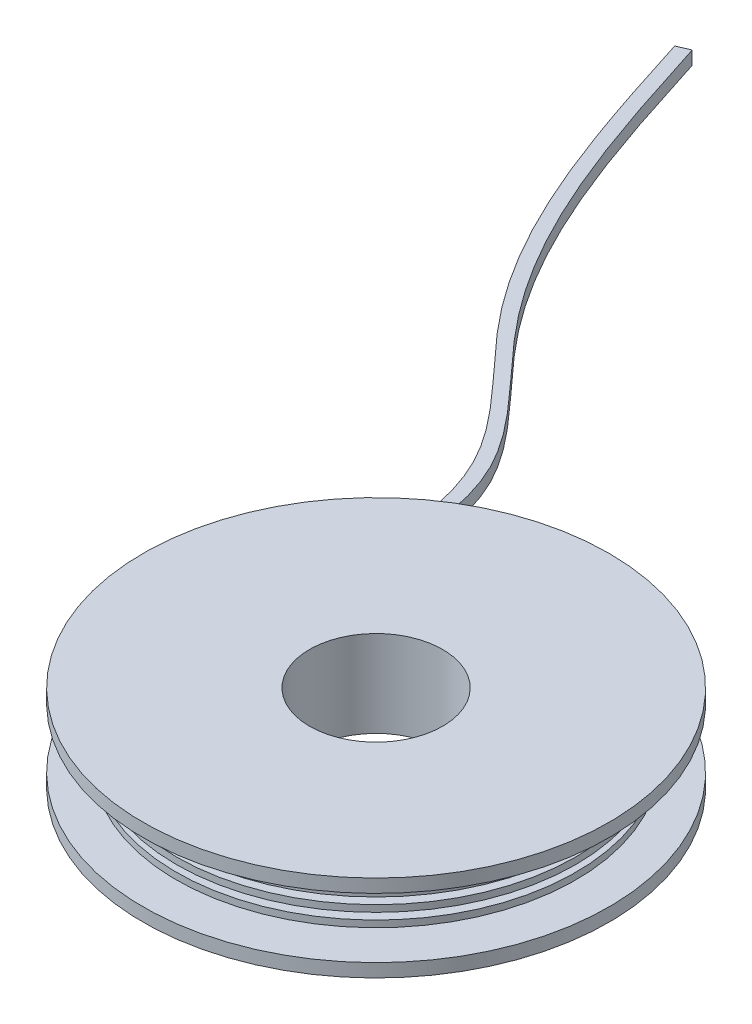
ISO-10303-21;
HEADER;
FILE_DESCRIPTION(('STEP AP214'),'2;1');
FILE_NAME('part.step','',(''),(''),'','','');
FILE_SCHEMA(('AUTOMOTIVE_DESIGN { 1 0 10303 214 1 1 1 1 }'));
ENDSEC;
DATA;
#1=APPLICATION_CONTEXT('core data for automotive mechanical design processes');
#2=APPLICATION_PROTOCOL_DEFINITION('international standard','automotive_design',2000,#1);
#3=PRODUCT_CONTEXT('',#1,'mechanical');
#4=PRODUCT('Part','Part','',(#3));
#5=PRODUCT_RELATED_PRODUCT_CATEGORY('part','',(#4));
#6=PRODUCT_DEFINITION_FORMATION('','',#4);
#7=PRODUCT_DEFINITION_CONTEXT('part definition',#1,'design');
#8=PRODUCT_DEFINITION('design','',#6,#7);
#9=PRODUCT_DEFINITION_SHAPE('','',#8);
#10=(LENGTH_UNIT() NAMED_UNIT(*) SI_UNIT(.MILLI.,.METRE.));
#11=(NAMED_UNIT(*) PLANE_ANGLE_UNIT() SI_UNIT($,.RADIAN.));
#12=(NAMED_UNIT(*) SI_UNIT($,.STERADIAN.) SOLID_ANGLE_UNIT());
#13=UNCERTAINTY_MEASURE_WITH_UNIT(LENGTH_MEASURE(1.E-05),#10,'distance_accuracy_value','');
#14=(GEOMETRIC_REPRESENTATION_CONTEXT(3) GLOBAL_UNCERTAINTY_ASSIGNED_CONTEXT((#13)) GLOBAL_UNIT_ASSIGNED_CONTEXT((#10,
#11,#12)) REPRESENTATION_CONTEXT('',''));
#15=CARTESIAN_POINT('',(0.,0.,0.));
#16=DIRECTION('',(0.,0.,1.));
#17=DIRECTION('',(1.,0.,0.));
#18=AXIS2_PLACEMENT_3D('',#15,#16,#17);
#19=CARTESIAN_POINT('',(0.,13.,0.));
#20=DIRECTION('',(0.,1.,0.));
#21=DIRECTION('',(0.,0.,1.));
#22=AXIS2_PLACEMENT_3D('',#19,#20,#21);
#23=PLANE('',#22);
#24=CARTESIAN_POINT('',(0.,13.,0.));
#25=DIRECTION('',(0.,1.,0.));
#26=DIRECTION('',(0.,0.,1.));
#27=AXIS2_PLACEMENT_3D('',#24,#25,#26);
#28=CIRCLE('',#27,10.);
#29=CARTESIAN_POINT('',(0.,13.,10.));
#30=VERTEX_POINT('',#29);
#31=EDGE_CURVE('E114',#30,#30,#28,.T.);
#32=ORIENTED_EDGE('',*,*,#31,.F.);
#33=EDGE_LOOP('',(#32));
#34=FACE_BOUND('',#33,.T.);
#35=CARTESIAN_POINT('',(0.,13.,0.));
#36=DIRECTION('',(0.,-1.,0.));
#37=DIRECTION('',(0.,0.,-1.));
#38=AXIS2_PLACEMENT_3D('',#35,#36,#37);
#39=CIRCLE('',#38,35.);
#40=CARTESIAN_POINT('',(0.,13.,-35.));
#41=VERTEX_POINT('',#40);
#42=EDGE_CURVE('E11',#41,#41,#39,.T.);
#43=ORIENTED_EDGE('',*,*,#42,.F.);
#44=EDGE_LOOP('',(#43));
#45=FACE_BOUND('',#44,.T.);
#46=ADVANCED_FACE('F31',(#34,#45),#23,.T.);
#47=CARTESIAN_POINT('',(0.,0.,0.));
#48=DIRECTION('',(0.,-1.,0.));
#49=DIRECTION('',(0.,0.,-1.));
#50=AXIS2_PLACEMENT_3D('',#47,#48,#49);
#51=CYLINDRICAL_SURFACE('',#50,35.);
#52=ORIENTED_EDGE('',*,*,#42,.T.);
#53=EDGE_LOOP('',(#52));
#54=FACE_BOUND('',#53,.T.);
#55=CARTESIAN_POINT('',(0.,11.,0.));
#56=DIRECTION('',(0.,-1.,0.));
#57=DIRECTION('',(0.,0.,-1.));
#58=AXIS2_PLACEMENT_3D('',#55,#56,#57);
#59=CIRCLE('',#58,35.);
#60=CARTESIAN_POINT('',(0.,11.,-35.));
#61=VERTEX_POINT('',#60);
#62=EDGE_CURVE('E38',#61,#61,#59,.T.);
#63=ORIENTED_EDGE('',*,*,#62,.F.);
#64=EDGE_LOOP('',(#63));
#65=FACE_BOUND('',#64,.T.);
#66=ADVANCED_FACE('F231',(#54,#65),#51,.T.);
#67=CARTESIAN_POINT('',(35.,11.,0.));
#68=DIRECTION('',(0.,-1.,0.));
#69=DIRECTION('',(0.,0.,-1.));
#70=AXIS2_PLACEMENT_3D('',#67,#68,#69);
#71=PLANE('',#70);
#72=ORIENTED_EDGE('',*,*,#62,.T.);
#73=EDGE_LOOP('',(#72));
#74=FACE_BOUND('',#73,.T.);
#75=CARTESIAN_POINT('',(0.,11.,0.));
#76=DIRECTION('',(0.,-1.,0.));
#77=DIRECTION('',(0.,0.,-1.));
#78=AXIS2_PLACEMENT_3D('',#75,#76,#77);
#79=CIRCLE('',#78,25.);
#80=CARTESIAN_POINT('',(0.,11.,-25.));
#81=VERTEX_POINT('',#80);
#82=EDGE_CURVE('E243',#81,#81,#79,.T.);
#83=ORIENTED_EDGE('',*,*,#82,.F.);
#84=EDGE_LOOP('',(#83));
#85=FACE_BOUND('',#84,.T.);
#86=ADVANCED_FACE('F228',(#74,#85),#71,.T.);
#87=CARTESIAN_POINT('',(0.,0.,0.));
#88=DIRECTION('',(0.,-1.,0.));
#89=DIRECTION('',(0.,0.,-1.));
#90=AXIS2_PLACEMENT_3D('',#87,#88,#89);
#91=CYLINDRICAL_SURFACE('',#90,25.);
#92=ORIENTED_EDGE('',*,*,#82,.T.);
#93=EDGE_LOOP('',(#92));
#94=FACE_BOUND('',#93,.T.);
#95=CARTESIAN_POINT('',(0.,9.99999999999999,0.));
#96=DIRECTION('',(0.,-1.,0.));
#97=DIRECTION('',(0.,0.,-1.));
#98=AXIS2_PLACEMENT_3D('',#95,#96,#97);
#99=CIRCLE('',#98,25.);
#100=CARTESIAN_POINT('',(0.,9.99999999999999,-25.));
#101=VERTEX_POINT('',#100);
#102=EDGE_CURVE('E245',#101,#101,#99,.T.);
#103=ORIENTED_EDGE('',*,*,#102,.F.);
#104=EDGE_LOOP('',(#103));
#105=FACE_BOUND('',#104,.T.);
#106=ADVANCED_FACE('F224',(#94,#105),#91,.T.);
#107=CARTESIAN_POINT('',(25.,9.99999999999999,0.));
#108=DIRECTION('',(0.,1.,0.));
#109=DIRECTION('',(0.,0.,1.));
#110=AXIS2_PLACEMENT_3D('',#107,#108,#109);
#111=PLANE('',#110);
#112=ORIENTED_EDGE('',*,*,#102,.T.);
#113=EDGE_LOOP('',(#112));
#114=FACE_BOUND('',#113,.T.);
#115=CARTESIAN_POINT('',(0.,9.99999999999999,0.));
#116=DIRECTION('',(0.,-1.,0.));
#117=DIRECTION('',(0.,0.,-1.));
#118=AXIS2_PLACEMENT_3D('',#115,#116,#117);
#119=CIRCLE('',#118,30.);
#120=CARTESIAN_POINT('',(0.,9.99999999999999,-30.));
#121=VERTEX_POINT('',#120);
#122=EDGE_CURVE('E250',#121,#121,#119,.T.);
#123=ORIENTED_EDGE('',*,*,#122,.F.);
#124=EDGE_LOOP('',(#123));
#125=FACE_BOUND('',#124,.T.);
#126=ADVANCED_FACE('F220',(#114,#125),#111,.T.);
#127=CARTESIAN_POINT('',(0.,0.,0.));
#128=DIRECTION('',(0.,-1.,0.));
#129=DIRECTION('',(0.,0.,-1.));
#130=AXIS2_PLACEMENT_3D('',#127,#128,#129);
#131=CYLINDRICAL_SURFACE('',#130,30.);
#132=ORIENTED_EDGE('',*,*,#122,.T.);
#133=EDGE_LOOP('',(#132));
#134=FACE_BOUND('',#133,.T.);
#135=CARTESIAN_POINT('',(0.,8.99999999999999,0.));
#136=DIRECTION('',(0.,-1.,0.));
#137=DIRECTION('',(0.,0.,-1.));
#138=AXIS2_PLACEMENT_3D('',#135,#136,#137);
#139=CIRCLE('',#138,30.);
#140=CARTESIAN_POINT('',(0.,8.99999999999999,-30.));
#141=VERTEX_POINT('',#140);
#142=EDGE_CURVE('E253',#141,#141,#139,.T.);
#143=ORIENTED_EDGE('',*,*,#142,.F.);
#144=EDGE_LOOP('',(#143));
#145=FACE_BOUND('',#144,.T.);
#146=ADVANCED_FACE('F216',(#134,#145),#131,.T.);
#147=CARTESIAN_POINT('',(30.,8.99999999999999,0.));
#148=DIRECTION('',(0.,-1.,0.));
#149=DIRECTION('',(0.,0.,-1.));
#150=AXIS2_PLACEMENT_3D('',#147,#148,#149);
#151=PLANE('',#150);
#152=ORIENTED_EDGE('',*,*,#142,.T.);
#153=EDGE_LOOP('',(#152));
#154=FACE_BOUND('',#153,.T.);
#155=CARTESIAN_POINT('',(0.,8.99999999999999,0.));
#156=DIRECTION('',(0.,-1.,0.));
#157=DIRECTION('',(0.,0.,-1.));
#158=AXIS2_PLACEMENT_3D('',#155,#156,#157);
#159=CIRCLE('',#158,25.);
#160=CARTESIAN_POINT('',(0.,8.99999999999999,-25.));
#161=VERTEX_POINT('',#160);
#162=EDGE_CURVE('E256',#161,#161,#159,.T.);
#163=ORIENTED_EDGE('',*,*,#162,.F.);
#164=EDGE_LOOP('',(#163));
#165=FACE_BOUND('',#164,.T.);
#166=ADVANCED_FACE('F212',(#154,#165),#151,.T.);
#167=CARTESIAN_POINT('',(0.,0.,0.));
#168=DIRECTION('',(0.,-1.,0.));
#169=DIRECTION('',(0.,0.,-1.));
#170=AXIS2_PLACEMENT_3D('',#167,#168,#169);
#171=CYLINDRICAL_SURFACE('',#170,25.);
#172=ORIENTED_EDGE('',*,*,#162,.T.);
#173=EDGE_LOOP('',(#172));
#174=FACE_BOUND('',#173,.T.);
#175=CARTESIAN_POINT('',(0.,7.99999999999999,0.));
#176=DIRECTION('',(0.,-1.,0.));
#177=DIRECTION('',(0.,0.,-1.));
#178=AXIS2_PLACEMENT_3D('',#175,#176,#177);
#179=CIRCLE('',#178,25.);
#180=CARTESIAN_POINT('',(0.,7.99999999999999,-25.));
#181=VERTEX_POINT('',#180);
#182=EDGE_CURVE('E259',#181,#181,#179,.T.);
#183=ORIENTED_EDGE('',*,*,#182,.F.);
#184=EDGE_LOOP('',(#183));
#185=FACE_BOUND('',#184,.T.);
#186=ADVANCED_FACE('F208',(#174,#185),#171,.T.);
#187=CARTESIAN_POINT('',(25.,7.99999999999999,0.));
#188=DIRECTION('',(0.,1.,0.));
#189=DIRECTION('',(0.,0.,1.));
#190=AXIS2_PLACEMENT_3D('',#187,#188,#189);
#191=PLANE('',#190);
#192=ORIENTED_EDGE('',*,*,#182,.T.);
#193=EDGE_LOOP('',(#192));
#194=FACE_BOUND('',#193,.T.);
#195=CARTESIAN_POINT('',(0.,8.,0.));
#196=DIRECTION('',(0.,-1.,0.));
#197=DIRECTION('',(0.,0.,-1.));
#198=AXIS2_PLACEMENT_3D('',#195,#196,#197);
#199=CIRCLE('',#198,30.);
#200=CARTESIAN_POINT('',(0.,8.,-30.));
#201=VERTEX_POINT('',#200);
#202=EDGE_CURVE('E262',#201,#201,#199,.T.);
#203=ORIENTED_EDGE('',*,*,#202,.F.);
#204=EDGE_LOOP('',(#203));
#205=FACE_BOUND('',#204,.T.);
#206=ADVANCED_FACE('F204',(#194,#205),#191,.T.);
#207=CARTESIAN_POINT('',(0.,0.,0.));
#208=DIRECTION('',(0.,-1.,0.));
#209=DIRECTION('',(0.,0.,-1.));
#210=AXIS2_PLACEMENT_3D('',#207,#208,#209);
#211=CYLINDRICAL_SURFACE('',#210,30.);
#212=ORIENTED_EDGE('',*,*,#202,.T.);
#213=EDGE_LOOP('',(#212));
#214=FACE_BOUND('',#213,.T.);
#215=CARTESIAN_POINT('',(0.,7.,0.));
#216=DIRECTION('',(0.,-1.,0.));
#217=DIRECTION('',(0.,0.,-1.));
#218=AXIS2_PLACEMENT_3D('',#215,#216,#217);
#219=CIRCLE('',#218,30.);
#220=CARTESIAN_POINT('',(0.,7.,-30.));
#221=VERTEX_POINT('',#220);
#222=EDGE_CURVE('E265',#221,#221,#219,.T.);
#223=ORIENTED_EDGE('',*,*,#222,.F.);
#224=EDGE_LOOP('',(#223));
#225=FACE_BOUND('',#224,.T.);
#226=ADVANCED_FACE('F200',(#214,#225),#211,.T.);
#227=CARTESIAN_POINT('',(30.,7.,0.));
#228=DIRECTION('',(0.,-1.,0.));
#229=DIRECTION('',(0.,0.,-1.));
#230=AXIS2_PLACEMENT_3D('',#227,#228,#229);
#231=PLANE('',#230);
#232=ORIENTED_EDGE('',*,*,#222,.T.);
#233=EDGE_LOOP('',(#232));
#234=FACE_BOUND('',#233,.T.);
#235=CARTESIAN_POINT('',(0.,7.,0.));
#236=DIRECTION('',(0.,-1.,0.));
#237=DIRECTION('',(0.,0.,-1.));
#238=AXIS2_PLACEMENT_3D('',#235,#236,#237);
#239=CIRCLE('',#238,25.);
#240=CARTESIAN_POINT('',(0.,7.,-25.));
#241=VERTEX_POINT('',#240);
#242=EDGE_CURVE('E268',#241,#241,#239,.T.);
#243=ORIENTED_EDGE('',*,*,#242,.F.);
#244=EDGE_LOOP('',(#243));
#245=FACE_BOUND('',#244,.T.);
#246=ADVANCED_FACE('F196',(#234,#245),#231,.T.);
#247=CARTESIAN_POINT('',(0.,0.,0.));
#248=DIRECTION('',(0.,-1.,0.));
#249=DIRECTION('',(0.,0.,-1.));
#250=AXIS2_PLACEMENT_3D('',#247,#248,#249);
#251=CYLINDRICAL_SURFACE('',#250,25.);
#252=ORIENTED_EDGE('',*,*,#242,.T.);
#253=EDGE_LOOP('',(#252));
#254=FACE_BOUND('',#253,.T.);
#255=CARTESIAN_POINT('',(0.,6.,0.));
#256=DIRECTION('',(0.,-1.,0.));
#257=DIRECTION('',(0.,0.,-1.));
#258=AXIS2_PLACEMENT_3D('',#255,#256,#257);
#259=CIRCLE('',#258,25.);
#260=CARTESIAN_POINT('',(0.,6.,-25.));
#261=VERTEX_POINT('',#260);
#262=EDGE_CURVE('E271',#261,#261,#259,.T.);
#263=ORIENTED_EDGE('',*,*,#262,.F.);
#264=EDGE_LOOP('',(#263));
#265=FACE_BOUND('',#264,.T.);
#266=ADVANCED_FACE('F192',(#254,#265),#251,.T.);
#267=CARTESIAN_POINT('',(30.,6.,0.));
#268=DIRECTION('',(0.,1.,0.));
#269=DIRECTION('',(0.,0.,1.));
#270=AXIS2_PLACEMENT_3D('',#267,#268,#269);
#271=PLANE('',#270);
#272=ORIENTED_EDGE('',*,*,#262,.T.);
#273=EDGE_LOOP('',(#272));
#274=FACE_BOUND('',#273,.T.);
#275=CARTESIAN_POINT('',(0.,6.,0.));
#276=DIRECTION('',(0.,-1.,0.));
#277=DIRECTION('',(0.,0.,-1.));
#278=AXIS2_PLACEMENT_3D('',#275,#276,#277);
#279=CIRCLE('',#278,30.);
#280=CARTESIAN_POINT('',(0.,6.,-30.));
#281=VERTEX_POINT('',#280);
#282=EDGE_CURVE('E274',#281,#281,#279,.T.);
#283=ORIENTED_EDGE('',*,*,#282,.F.);
#284=EDGE_LOOP('',(#283));
#285=FACE_BOUND('',#284,.T.);
#286=ADVANCED_FACE('F188',(#274,#285),#271,.T.);
#287=CARTESIAN_POINT('',(0.,0.,0.));
#288=DIRECTION('',(0.,-1.,0.));
#289=DIRECTION('',(0.,0.,-1.));
#290=AXIS2_PLACEMENT_3D('',#287,#288,#289);
#291=CYLINDRICAL_SURFACE('',#290,30.);
#292=ORIENTED_EDGE('',*,*,#282,.T.);
#293=EDGE_LOOP('',(#292));
#294=FACE_BOUND('',#293,.T.);
#295=CARTESIAN_POINT('',(0.,5.,0.));
#296=DIRECTION('',(0.,-1.,0.));
#297=DIRECTION('',(0.,0.,-1.));
#298=AXIS2_PLACEMENT_3D('',#295,#296,#297);
#299=CIRCLE('',#298,30.);
#300=CARTESIAN_POINT('',(0.,5.,-30.));
#301=VERTEX_POINT('',#300);
#302=EDGE_CURVE('E277',#301,#301,#299,.T.);
#303=ORIENTED_EDGE('',*,*,#302,.F.);
#304=EDGE_LOOP('',(#303));
#305=FACE_BOUND('',#304,.T.);
#306=ADVANCED_FACE('F184',(#294,#305),#291,.T.);
#307=CARTESIAN_POINT('',(25.,5.,0.));
#308=DIRECTION('',(0.,-1.,0.));
#309=DIRECTION('',(0.,0.,-1.));
#310=AXIS2_PLACEMENT_3D('',#307,#308,#309);
#311=PLANE('',#310);
#312=ORIENTED_EDGE('',*,*,#302,.T.);
#313=EDGE_LOOP('',(#312));
#314=FACE_BOUND('',#313,.T.);
#315=CARTESIAN_POINT('',(0.,5.,0.));
#316=DIRECTION('',(0.,-1.,0.));
#317=DIRECTION('',(0.,0.,-1.));
#318=AXIS2_PLACEMENT_3D('',#315,#316,#317);
#319=CIRCLE('',#318,25.);
#320=CARTESIAN_POINT('',(0.,5.,-25.));
#321=VERTEX_POINT('',#320);
#322=EDGE_CURVE('E280',#321,#321,#319,.T.);
#323=ORIENTED_EDGE('',*,*,#322,.F.);
#324=EDGE_LOOP('',(#323));
#325=FACE_BOUND('',#324,.T.);
#326=ADVANCED_FACE('F180',(#314,#325),#311,.T.);
#327=CARTESIAN_POINT('',(0.,0.,0.));
#328=DIRECTION('',(0.,-1.,0.));
#329=DIRECTION('',(0.,0.,-1.));
#330=AXIS2_PLACEMENT_3D('',#327,#328,#329);
#331=CYLINDRICAL_SURFACE('',#330,25.);
#332=ORIENTED_EDGE('',*,*,#322,.T.);
#333=EDGE_LOOP('',(#332));
#334=FACE_BOUND('',#333,.T.);
#335=CARTESIAN_POINT('',(0.,4.,0.));
#336=DIRECTION('',(0.,-1.,0.));
#337=DIRECTION('',(0.,0.,-1.));
#338=AXIS2_PLACEMENT_3D('',#335,#336,#337);
#339=CIRCLE('',#338,25.);
#340=CARTESIAN_POINT('',(0.,4.,-25.));
#341=VERTEX_POINT('',#340);
#342=EDGE_CURVE('E283',#341,#341,#339,.T.);
#343=ORIENTED_EDGE('',*,*,#342,.F.);
#344=EDGE_LOOP('',(#343));
#345=FACE_BOUND('',#344,.T.);
#346=ADVANCED_FACE('F176',(#334,#345),#331,.T.);
#347=CARTESIAN_POINT('',(30.,4.,0.));
#348=DIRECTION('',(0.,1.,0.));
#349=DIRECTION('',(0.,0.,1.));
#350=AXIS2_PLACEMENT_3D('',#347,#348,#349);
#351=PLANE('',#350);
#352=CARTESIAN_POINT('',(0.,4.,0.));
#353=DIRECTION('',(0.,-1.,0.));
#354=DIRECTION('',(0.,0.,-1.));
#355=AXIS2_PLACEMENT_3D('',#352,#353,#354);
#356=CIRCLE('',#355,30.);
#357=CARTESIAN_POINT('',(-27.3272002121338,4.,-12.3783734216557));
#358=VERTEX_POINT('',#357);
#359=CARTESIAN_POINT('',(-29.3272002121338,4.,-6.31785784245082));
#360=VERTEX_POINT('',#359);
#361=EDGE_CURVE('E49',#358,#360,#356,.T.);
#362=ORIENTED_EDGE('',*,*,#361,.F.);
#363=CARTESIAN_POINT('',(-68.2349270573465,4.,-115.720051734681));
#364=CARTESIAN_POINT('',(-62.6677313254013,4.,-98.1876957146622));
#365=CARTESIAN_POINT('',(-54.5190497611558,4.,-72.5256581005833));
#366=CARTESIAN_POINT('',(-23.311002372019,4.,-45.1883087801359));
#367=CARTESIAN_POINT('',(-25.5840102643851,4.,-25.0966753384625));
#368=CARTESIAN_POINT('',(-27.3272002121338,4.,-12.3783734216557));
#369=B_SPLINE_CURVE_WITH_KNOTS('',3,(#363,#364,#365,#366,#367,#368),.UNSPECIFIED.,.F.,.F.,(4,1,
1,4),(0.,0.472576041097984,0.691707613530188,1.),.UNSPECIFIED.);
#370=CARTESIAN_POINT('',(-68.2349270573465,4.,-115.720051734681));
#371=VERTEX_POINT('',#370);
#372=EDGE_CURVE('E133',#371,#358,#369,.T.);
#373=ORIENTED_EDGE('',*,*,#372,.F.);
#374=DIRECTION('',(0.9172292603573,0.,-0.398359741872094));
#375=VECTOR('',#374,1.);
#376=CARTESIAN_POINT('',(-70.0693855780611,4.,-114.923332250937));
#377=LINE('',#376,#375);
#378=CARTESIAN_POINT('',(-70.0693855780611,4.,-114.923332250937));
#379=VERTEX_POINT('',#378);
#380=EDGE_CURVE('E93',#379,#371,#377,.T.);
#381=ORIENTED_EDGE('',*,*,#380,.F.);
#382=CARTESIAN_POINT('',(-29.3272002121338,4.,-6.31785784245081));
#383=CARTESIAN_POINT('',(-27.376461724873,4.,-20.5051174359009));
#384=CARTESIAN_POINT('',(-24.1795196633313,4.,-43.755720850201));
#385=CARTESIAN_POINT('',(-56.295044404957,4.,-71.5733088298242));
#386=CARTESIAN_POINT('',(-64.4784596946282,4.,-97.3278069951977));
#387=CARTESIAN_POINT('',(-70.0693855780611,4.,-114.923332250937));
#388=B_SPLINE_CURVE_WITH_KNOTS('',3,(#382,#383,#384,#385,#386,#387),.UNSPECIFIED.,.F.,.F.,(4,1,
1,4),(0.,0.331505275215326,0.543283051459661,1.),.UNSPECIFIED.);
#389=EDGE_CURVE('E138',#360,#379,#388,.T.);
#390=ORIENTED_EDGE('',*,*,#389,.F.);
#391=EDGE_LOOP('',(#362,#373,#381,#390));
#392=FACE_BOUND('',#391,.T.);
#393=ORIENTED_EDGE('',*,*,#342,.T.);
#394=EDGE_LOOP('',(#393));
#395=FACE_BOUND('',#394,.T.);
#396=ADVANCED_FACE('F173',(#392,#395),#351,.T.);
#397=CARTESIAN_POINT('',(0.,0.,0.));
#398=DIRECTION('',(0.,-1.,0.));
#399=DIRECTION('',(0.,0.,-1.));
#400=AXIS2_PLACEMENT_3D('',#397,#398,#399);
#401=CYLINDRICAL_SURFACE('',#400,30.);
#402=DIRECTION('',(0.,-1.,0.));
#403=VECTOR('',#402,1.);
#404=CARTESIAN_POINT('',(-29.3272002121338,4.,-6.31785784245082));
#405=LINE('',#404,#403);
#406=CARTESIAN_POINT('',(-29.3272002121338,3.,-6.31785784245082));
#407=VERTEX_POINT('',#406);
#408=EDGE_CURVE('E303',#360,#407,#405,.T.);
#409=ORIENTED_EDGE('',*,*,#408,.T.);
#410=CARTESIAN_POINT('',(0.,3.,0.));
#411=DIRECTION('',(0.,-1.,0.));
#412=DIRECTION('',(0.,0.,-1.));
#413=AXIS2_PLACEMENT_3D('',#410,#411,#412);
#414=CIRCLE('',#413,30.);
#415=CARTESIAN_POINT('',(-27.3272002121338,3.,-12.3783734216557));
#416=VERTEX_POINT('',#415);
#417=EDGE_CURVE('E287',#416,#407,#414,.T.);
#418=ORIENTED_EDGE('',*,*,#417,.F.);
#419=DIRECTION('',(0.,-1.,0.));
#420=VECTOR('',#419,1.);
#421=CARTESIAN_POINT('',(-27.3272002121338,4.,-12.3783734216557));
#422=LINE('',#421,#420);
#423=EDGE_CURVE('E45',#358,#416,#422,.T.);
#424=ORIENTED_EDGE('',*,*,#423,.F.);
#425=ORIENTED_EDGE('',*,*,#361,.T.);
#426=EDGE_LOOP('',(#409,#418,#424,#425));
#427=FACE_BOUND('',#426,.T.);
#428=ADVANCED_FACE('F169',(#427),#401,.T.);
#429=CARTESIAN_POINT('',(25.,3.,0.));
#430=DIRECTION('',(0.,-1.,0.));
#431=DIRECTION('',(0.,0.,-1.));
#432=AXIS2_PLACEMENT_3D('',#429,#430,#431);
#433=PLANE('',#432);
#434=DIRECTION('',(-0.313381673346024,0.,0.949627256775439));
#435=VECTOR('',#434,1.);
#436=CARTESIAN_POINT('',(-25.871998382405,3.,-16.7880101016353));
#437=LINE('',#436,#435);
#438=EDGE_CURVE('E300',#416,#407,#437,.T.);
#439=ORIENTED_EDGE('',*,*,#438,.F.);
#440=ORIENTED_EDGE('',*,*,#417,.T.);
#441=EDGE_LOOP('',(#439,#440));
#442=FACE_BOUND('',#441,.T.);
#443=CARTESIAN_POINT('',(0.,3.,0.));
#444=DIRECTION('',(0.,-1.,0.));
#445=DIRECTION('',(0.,0.,-1.));
#446=AXIS2_PLACEMENT_3D('',#443,#444,#445);
#447=CIRCLE('',#446,25.);
#448=CARTESIAN_POINT('',(0.,3.,-25.));
#449=VERTEX_POINT('',#448);
#450=EDGE_CURVE('E289',#449,#449,#447,.T.);
#451=ORIENTED_EDGE('',*,*,#450,.F.);
#452=EDGE_LOOP('',(#451));
#453=FACE_BOUND('',#452,.T.);
#454=ADVANCED_FACE('F165',(#442,#453),#433,.T.);
#455=CARTESIAN_POINT('',(0.,0.,0.));
#456=DIRECTION('',(0.,-1.,0.));
#457=DIRECTION('',(0.,0.,-1.));
#458=AXIS2_PLACEMENT_3D('',#455,#456,#457);
#459=CYLINDRICAL_SURFACE('',#458,25.);
#460=ORIENTED_EDGE('',*,*,#450,.T.);
#461=EDGE_LOOP('',(#460));
#462=FACE_BOUND('',#461,.T.);
#463=CARTESIAN_POINT('',(0.,2.,0.));
#464=DIRECTION('',(0.,-1.,0.));
#465=DIRECTION('',(0.,0.,-1.));
#466=AXIS2_PLACEMENT_3D('',#463,#464,#465);
#467=CIRCLE('',#466,25.);
#468=CARTESIAN_POINT('',(0.,2.,-25.));
#469=VERTEX_POINT('',#468);
#470=EDGE_CURVE('E292',#469,#469,#467,.T.);
#471=ORIENTED_EDGE('',*,*,#470,.F.);
#472=EDGE_LOOP('',(#471));
#473=FACE_BOUND('',#472,.T.);
#474=ADVANCED_FACE('F162',(#462,#473),#459,.T.);
#475=CARTESIAN_POINT('',(35.,2.,0.));
#476=DIRECTION('',(0.,1.,0.));
#477=DIRECTION('',(0.,0.,1.));
#478=AXIS2_PLACEMENT_3D('',#475,#476,#477);
#479=PLANE('',#478);
#480=CARTESIAN_POINT('',(-68.2349270573465,2.,-115.720051734681));
#481=CARTESIAN_POINT('',(-62.6677313254013,2.,-98.1876957146622));
#482=CARTESIAN_POINT('',(-54.5190497611558,2.,-72.5256581005833));
#483=CARTESIAN_POINT('',(-23.311002372019,2.,-45.1883087801359));
#484=CARTESIAN_POINT('',(-25.5840102643851,2.,-25.0966753384625));
#485=CARTESIAN_POINT('',(-27.3272002121338,2.,-12.3783734216557));
#486=B_SPLINE_CURVE_WITH_KNOTS('',3,(#480,#481,#482,#483,#484,#485),.UNSPECIFIED.,.F.,.F.,(4,1,
1,4),(0.,0.472576041097984,0.691707613530188,1.),.UNSPECIFIED.);
#487=CARTESIAN_POINT('',(-26.0442264273571,2.,-23.3815797114001));
#488=VERTEX_POINT('',#487);
#489=CARTESIAN_POINT('',(-27.3272002121338,2.,-12.3783734216557));
#490=VERTEX_POINT('',#489);
#491=EDGE_CURVE('E88',#488,#490,#486,.T.);
#492=ORIENTED_EDGE('',*,*,#491,.T.);
#493=DIRECTION('',(-0.313381673346024,0.,0.949627256775439));
#494=VECTOR('',#493,1.);
#495=CARTESIAN_POINT('',(-27.3272002121338,2.,-12.3783734216557));
#496=LINE('',#495,#494);
#497=CARTESIAN_POINT('',(-29.3272002121338,2.,-6.31785784245082));
#498=VERTEX_POINT('',#497);
#499=EDGE_CURVE('E96',#490,#498,#496,.T.);
#500=ORIENTED_EDGE('',*,*,#499,.T.);
#501=CARTESIAN_POINT('',(-29.3272002121338,2.,-6.31785784245081));
#502=CARTESIAN_POINT('',(-27.376461724873,2.,-20.5051174359009));
#503=CARTESIAN_POINT('',(-24.1795196633313,2.,-43.755720850201));
#504=CARTESIAN_POINT('',(-56.295044404957,2.,-71.5733088298242));
#505=CARTESIAN_POINT('',(-64.4784596946282,2.,-97.3278069951977));
#506=CARTESIAN_POINT('',(-70.0693855780611,2.,-114.923332250937));
#507=B_SPLINE_CURVE_WITH_KNOTS('',3,(#501,#502,#503,#504,#505,#506),.UNSPECIFIED.,.F.,.F.,(4,1,
1,4),(0.,0.331505275215326,0.543283051459661,1.),.UNSPECIFIED.);
#508=CARTESIAN_POINT('',(-27.5751659835893,2.,-21.5548189734338));
#509=VERTEX_POINT('',#508);
#510=EDGE_CURVE('E123',#498,#509,#507,.T.);
#511=ORIENTED_EDGE('',*,*,#510,.T.);
#512=CARTESIAN_POINT('',(0.,2.,0.));
#513=DIRECTION('',(0.,-1.,0.));
#514=DIRECTION('',(0.,0.,-1.));
#515=AXIS2_PLACEMENT_3D('',#512,#513,#514);
#516=CIRCLE('',#515,35.);
#517=EDGE_CURVE('E109',#488,#509,#516,.T.);
#518=ORIENTED_EDGE('',*,*,#517,.F.);
#519=EDGE_LOOP('',(#492,#500,#511,#518));
#520=FACE_BOUND('',#519,.T.);
#521=ORIENTED_EDGE('',*,*,#470,.T.);
#522=EDGE_LOOP('',(#521));
#523=FACE_BOUND('',#522,.T.);
#524=ADVANCED_FACE('F106',(#520,#523),#479,.T.);
#525=CARTESIAN_POINT('',(0.,0.,0.));
#526=DIRECTION('',(0.,-1.,0.));
#527=DIRECTION('',(0.,0.,-1.));
#528=AXIS2_PLACEMENT_3D('',#525,#526,#527);
#529=CYLINDRICAL_SURFACE('',#528,35.);
#530=EDGE_CURVE('E295',#509,#488,#516,.T.);
#531=ORIENTED_EDGE('',*,*,#530,.T.);
#532=ORIENTED_EDGE('',*,*,#517,.T.);
#533=EDGE_LOOP('',(#531,#532));
#534=FACE_BOUND('',#533,.T.);
#535=CARTESIAN_POINT('',(0.,0.,0.));
#536=DIRECTION('',(0.,-1.,0.));
#537=DIRECTION('',(0.,0.,-1.));
#538=AXIS2_PLACEMENT_3D('',#535,#536,#537);
#539=CIRCLE('',#538,35.);
#540=CARTESIAN_POINT('',(0.,0.,-35.));
#541=VERTEX_POINT('',#540);
#542=EDGE_CURVE('E297',#541,#541,#539,.T.);
#543=ORIENTED_EDGE('',*,*,#542,.F.);
#544=EDGE_LOOP('',(#543));
#545=FACE_BOUND('',#544,.T.);
#546=ADVANCED_FACE('F155',(#534,#545),#529,.T.);
#547=CARTESIAN_POINT('',(0.,0.,0.));
#548=DIRECTION('',(0.,-1.,0.));
#549=DIRECTION('',(0.,0.,-1.));
#550=AXIS2_PLACEMENT_3D('',#547,#548,#549);
#551=PLANE('',#550);
#552=CARTESIAN_POINT('',(0.,0.,0.));
#553=DIRECTION('',(0.,1.,0.));
#554=DIRECTION('',(0.,0.,1.));
#555=AXIS2_PLACEMENT_3D('',#552,#553,#554);
#556=CIRCLE('',#555,10.);
#557=CARTESIAN_POINT('',(0.,0.,10.));
#558=VERTEX_POINT('',#557);
#559=EDGE_CURVE('E111',#558,#558,#556,.T.);
#560=ORIENTED_EDGE('',*,*,#559,.T.);
#561=EDGE_LOOP('',(#560));
#562=FACE_BOUND('',#561,.T.);
#563=ORIENTED_EDGE('',*,*,#542,.T.);
#564=EDGE_LOOP('',(#563));
#565=FACE_BOUND('',#564,.T.);
#566=ADVANCED_FACE('F151',(#562,#565),#551,.T.);
#567=DIRECTION('',(0.,-1.,0.));
#568=VECTOR('',#567,1.);
#569=SURFACE_OF_LINEAR_EXTRUSION('',#369,#568);
#570=ORIENTED_EDGE('',*,*,#423,.T.);
#571=EDGE_CURVE('E83',#416,#490,#422,.T.);
#572=ORIENTED_EDGE('',*,*,#571,.T.);
#573=ORIENTED_EDGE('',*,*,#491,.F.);
#574=CARTESIAN_POINT('',(-68.2349270573465,2.,-115.720051734681));
#575=VERTEX_POINT('',#574);
#576=EDGE_CURVE('E104',#575,#488,#486,.T.);
#577=ORIENTED_EDGE('',*,*,#576,.F.);
#578=DIRECTION('',(0.,-1.,0.));
#579=VECTOR('',#578,1.);
#580=CARTESIAN_POINT('',(-68.2349270573465,4.,-115.720051734681));
#581=LINE('',#580,#579);
#582=EDGE_CURVE('E301',#371,#575,#581,.T.);
#583=ORIENTED_EDGE('',*,*,#582,.F.);
#584=ORIENTED_EDGE('',*,*,#372,.T.);
#585=EDGE_LOOP('',(#570,#572,#573,#577,#583,#584));
#586=FACE_BOUND('',#585,.T.);
#587=ADVANCED_FACE('F85',(#586),#569,.T.);
#588=CARTESIAN_POINT('',(-70.0693855780611,4.,-114.923332250937));
#589=DIRECTION('',(-0.398359741872094,0.,-0.9172292603573));
#590=DIRECTION('',(-0.9172292603573,0.,0.398359741872094));
#591=AXIS2_PLACEMENT_3D('',#588,#589,#590);
#592=PLANE('',#591);
#593=ORIENTED_EDGE('',*,*,#582,.T.);
#594=DIRECTION('',(0.9172292603573,0.,-0.398359741872094));
#595=VECTOR('',#594,1.);
#596=CARTESIAN_POINT('',(-70.0693855780611,2.,-114.923332250937));
#597=LINE('',#596,#595);
#598=CARTESIAN_POINT('',(-70.0693855780611,2.,-114.923332250937));
#599=VERTEX_POINT('',#598);
#600=EDGE_CURVE('E127',#599,#575,#597,.T.);
#601=ORIENTED_EDGE('',*,*,#600,.F.);
#602=DIRECTION('',(0.,-1.,0.));
#603=VECTOR('',#602,1.);
#604=CARTESIAN_POINT('',(-70.0693855780611,4.,-114.923332250937));
#605=LINE('',#604,#603);
#606=EDGE_CURVE('E305',#379,#599,#605,.T.);
#607=ORIENTED_EDGE('',*,*,#606,.F.);
#608=ORIENTED_EDGE('',*,*,#380,.T.);
#609=EDGE_LOOP('',(#593,#601,#607,#608));
#610=FACE_BOUND('',#609,.T.);
#611=ADVANCED_FACE('F150',(#610),#592,.T.);
#612=DIRECTION('',(0.,-1.,0.));
#613=VECTOR('',#612,1.);
#614=SURFACE_OF_LINEAR_EXTRUSION('',#388,#613);
#615=ORIENTED_EDGE('',*,*,#606,.T.);
#616=EDGE_CURVE('E103',#509,#599,#507,.T.);
#617=ORIENTED_EDGE('',*,*,#616,.F.);
#618=ORIENTED_EDGE('',*,*,#510,.F.);
#619=EDGE_CURVE('E99',#407,#498,#405,.T.);
#620=ORIENTED_EDGE('',*,*,#619,.F.);
#621=ORIENTED_EDGE('',*,*,#408,.F.);
#622=ORIENTED_EDGE('',*,*,#389,.T.);
#623=EDGE_LOOP('',(#615,#617,#618,#620,#621,#622));
#624=FACE_BOUND('',#623,.T.);
#625=ADVANCED_FACE('F314',(#624),#614,.T.);
#626=CARTESIAN_POINT('',(-27.3272002121338,4.,-12.3783734216557));
#627=DIRECTION('',(0.949627256775439,0.,0.313381673346024));
#628=DIRECTION('',(0.313381673346024,0.,-0.949627256775439));
#629=AXIS2_PLACEMENT_3D('',#626,#627,#628);
#630=PLANE('',#629);
#631=ORIENTED_EDGE('',*,*,#571,.F.);
#632=ORIENTED_EDGE('',*,*,#438,.T.);
#633=ORIENTED_EDGE('',*,*,#619,.T.);
#634=ORIENTED_EDGE('',*,*,#499,.F.);
#635=EDGE_LOOP('',(#631,#632,#633,#634));
#636=FACE_BOUND('',#635,.T.);
#637=ADVANCED_FACE('F97',(#636),#630,.T.);
#638=CARTESIAN_POINT('',(-43.145294509399,2.,-63.7999159439741));
#639=DIRECTION('',(0.,-1.,0.));
#640=DIRECTION('',(0.,0.,-1.));
#641=AXIS2_PLACEMENT_3D('',#638,#639,#640);
#642=PLANE('',#641);
#643=ORIENTED_EDGE('',*,*,#576,.T.);
#644=ORIENTED_EDGE('',*,*,#530,.F.);
#645=ORIENTED_EDGE('',*,*,#616,.T.);
#646=ORIENTED_EDGE('',*,*,#600,.T.);
#647=EDGE_LOOP('',(#643,#644,#645,#646));
#648=FACE_BOUND('',#647,.T.);
#649=ADVANCED_FACE('F320',(#648),#642,.T.);
#650=CARTESIAN_POINT('',(0.,0.,0.));
#651=DIRECTION('',(0.,1.,0.));
#652=DIRECTION('',(0.,0.,1.));
#653=AXIS2_PLACEMENT_3D('',#650,#651,#652);
#654=CYLINDRICAL_SURFACE('',#653,10.);
#655=ORIENTED_EDGE('',*,*,#559,.F.);
#656=EDGE_LOOP('',(#655));
#657=FACE_BOUND('',#656,.T.);
#658=ORIENTED_EDGE('',*,*,#31,.T.);
#659=EDGE_LOOP('',(#658));
#660=FACE_BOUND('',#659,.T.);
#661=ADVANCED_FACE('F325',(#657,#660),#654,.F.);
#662=CLOSED_SHELL('',(#46,#66,#86,#106,#126,#146,#166,#186,#206,#226,#246,#266,#286,#306,#326,
#346,#396,#428,#454,#474,#524,#546,#566,#587,#611,#625,#637,#649,#661));
#663=MANIFOLD_SOLID_BREP('B2',#662);
#664=ADVANCED_BREP_SHAPE_REPRESENTATION('',(#18,#663),#14);
#665=SHAPE_DEFINITION_REPRESENTATION(#9,#664);
ENDSEC;
END-ISO-10303-21;
